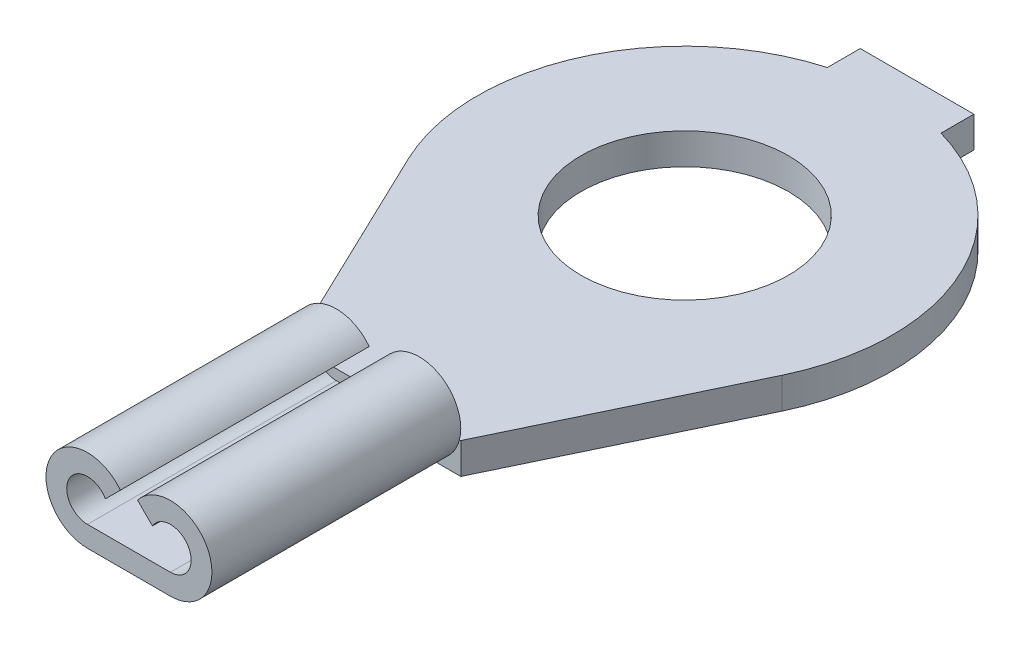
ISO-10303-21;
HEADER;
FILE_DESCRIPTION(('STEP AP214'),'2;1');
FILE_NAME('part.step','',(''),(''),'','','');
FILE_SCHEMA(('AUTOMOTIVE_DESIGN { 1 0 10303 214 1 1 1 1 }'));
ENDSEC;
DATA;
#1=APPLICATION_CONTEXT('core data for automotive mechanical design processes');
#2=APPLICATION_PROTOCOL_DEFINITION('international standard','automotive_design',2000,#1);
#3=PRODUCT_CONTEXT('',#1,'mechanical');
#4=PRODUCT('Part','Part','',(#3));
#5=PRODUCT_RELATED_PRODUCT_CATEGORY('part','',(#4));
#6=PRODUCT_DEFINITION_FORMATION('','',#4);
#7=PRODUCT_DEFINITION_CONTEXT('part definition',#1,'design');
#8=PRODUCT_DEFINITION('design','',#6,#7);
#9=PRODUCT_DEFINITION_SHAPE('','',#8);
#10=(LENGTH_UNIT() NAMED_UNIT(*) SI_UNIT(.MILLI.,.METRE.));
#11=(NAMED_UNIT(*) PLANE_ANGLE_UNIT() SI_UNIT($,.RADIAN.));
#12=(NAMED_UNIT(*) SI_UNIT($,.STERADIAN.) SOLID_ANGLE_UNIT());
#13=UNCERTAINTY_MEASURE_WITH_UNIT(LENGTH_MEASURE(1.E-05),#10,'distance_accuracy_value','');
#14=(GEOMETRIC_REPRESENTATION_CONTEXT(3) GLOBAL_UNCERTAINTY_ASSIGNED_CONTEXT((#13)) GLOBAL_UNIT_ASSIGNED_CONTEXT((#10,
#11,#12)) REPRESENTATION_CONTEXT('',''));
#15=CARTESIAN_POINT('',(0.,0.,0.));
#16=DIRECTION('',(0.,0.,1.));
#17=DIRECTION('',(1.,0.,0.));
#18=AXIS2_PLACEMENT_3D('',#15,#16,#17);
#19=CARTESIAN_POINT('',(0.,0.,0.));
#20=DIRECTION('',(0.,1.,0.));
#21=DIRECTION('',(0.,0.,1.));
#22=AXIS2_PLACEMENT_3D('',#19,#20,#21);
#23=PLANE('',#22);
#24=CARTESIAN_POINT('',(0.,0.,0.));
#25=DIRECTION('',(0.,1.,0.));
#26=DIRECTION('',(0.,0.,1.));
#27=AXIS2_PLACEMENT_3D('',#24,#25,#26);
#28=CIRCLE('',#27,1.27);
#29=CARTESIAN_POINT('',(0.,0.,1.27));
#30=VERTEX_POINT('',#29);
#31=EDGE_CURVE('E342',#30,#30,#28,.T.);
#32=ORIENTED_EDGE('',*,*,#31,.T.);
#33=EDGE_LOOP('',(#32));
#34=FACE_BOUND('',#33,.T.);
#35=DIRECTION('',(0.,0.,1.));
#36=VECTOR('',#35,1.);
#37=CARTESIAN_POINT('',(0.508,0.,3.7585209668621));
#38=LINE('',#37,#36);
#39=CARTESIAN_POINT('',(0.508,0.,3.7585209668621));
#40=VERTEX_POINT('',#39);
#41=CARTESIAN_POINT('',(0.508,0.,6.8065209668621));
#42=VERTEX_POINT('',#41);
#43=EDGE_CURVE('E374',#40,#42,#38,.T.);
#44=ORIENTED_EDGE('',*,*,#43,.T.);
#45=DIRECTION('',(1.,0.,0.));
#46=VECTOR('',#45,1.);
#47=CARTESIAN_POINT('',(-1.016,0.,6.8065209668621));
#48=LINE('',#47,#46);
#49=CARTESIAN_POINT('',(-0.508,0.,6.8065209668621));
#50=VERTEX_POINT('',#49);
#51=EDGE_CURVE('E265',#50,#42,#48,.T.);
#52=ORIENTED_EDGE('',*,*,#51,.F.);
#53=DIRECTION('',(0.,0.,1.));
#54=VECTOR('',#53,1.);
#55=CARTESIAN_POINT('',(-0.508,0.,3.7585209668621));
#56=LINE('',#55,#54);
#57=CARTESIAN_POINT('',(-0.508,0.,3.7585209668621));
#58=VERTEX_POINT('',#57);
#59=EDGE_CURVE('E305',#58,#50,#56,.T.);
#60=ORIENTED_EDGE('',*,*,#59,.F.);
#61=DIRECTION('',(1.,0.,0.));
#62=VECTOR('',#61,1.);
#63=CARTESIAN_POINT('',(0.,0.,3.7585209668621));
#64=LINE('',#63,#62);
#65=CARTESIAN_POINT('',(-1.016,0.,3.7585209668621));
#66=VERTEX_POINT('',#65);
#67=EDGE_CURVE('E293',#66,#58,#64,.T.);
#68=ORIENTED_EDGE('',*,*,#67,.F.);
#69=DIRECTION('',(0.432004694375105,0.,0.901871356701094));
#70=VECTOR('',#69,1.);
#71=CARTESIAN_POINT('',(-1.016,0.,3.7585209668621));
#72=LINE('',#71,#70);
#73=CARTESIAN_POINT('',(-2.29075324602078,0.,1.09729192371277));
#74=VERTEX_POINT('',#73);
#75=EDGE_CURVE('E261',#74,#66,#72,.T.);
#76=ORIENTED_EDGE('',*,*,#75,.F.);
#77=CARTESIAN_POINT('',(0.,0.,0.));
#78=DIRECTION('',(0.,1.,0.));
#79=DIRECTION('',(0.,0.,1.));
#80=AXIS2_PLACEMENT_3D('',#77,#78,#79);
#81=CIRCLE('',#80,2.54);
#82=CARTESIAN_POINT('',(-0.695956455580593,0.,-2.44279442686766));
#83=VERTEX_POINT('',#82);
#84=EDGE_CURVE('E258',#83,#74,#81,.T.);
#85=ORIENTED_EDGE('',*,*,#84,.F.);
#86=DIRECTION('',(0.,0.,1.));
#87=VECTOR('',#86,1.);
#88=CARTESIAN_POINT('',(-0.695956455580593,0.,-2.44279442686766));
#89=LINE('',#88,#87);
#90=CARTESIAN_POINT('',(-0.695956455580593,0.,-2.84547903313789));
#91=VERTEX_POINT('',#90);
#92=EDGE_CURVE('E214',#91,#83,#89,.T.);
#93=ORIENTED_EDGE('',*,*,#92,.F.);
#94=DIRECTION('',(-1.,0.,0.));
#95=VECTOR('',#94,1.);
#96=CARTESIAN_POINT('',(-0.695956455580593,0.,-2.84547903313789));
#97=LINE('',#96,#95);
#98=CARTESIAN_POINT('',(0.695956455580593,0.,-2.84547903313789));
#99=VERTEX_POINT('',#98);
#100=EDGE_CURVE('E208',#99,#91,#97,.T.);
#101=ORIENTED_EDGE('',*,*,#100,.F.);
#102=DIRECTION('',(0.,0.,-1.));
#103=VECTOR('',#102,1.);
#104=CARTESIAN_POINT('',(0.695956455580593,0.,-2.44279442686766));
#105=LINE('',#104,#103);
#106=CARTESIAN_POINT('',(0.695956455580593,0.,-2.44279442686766));
#107=VERTEX_POINT('',#106);
#108=EDGE_CURVE('E248',#107,#99,#105,.T.);
#109=ORIENTED_EDGE('',*,*,#108,.F.);
#110=CARTESIAN_POINT('',(0.,0.,0.));
#111=DIRECTION('',(0.,1.,0.));
#112=DIRECTION('',(0.,0.,1.));
#113=AXIS2_PLACEMENT_3D('',#110,#111,#112);
#114=CIRCLE('',#113,2.54);
#115=CARTESIAN_POINT('',(2.29075324602078,0.,1.09729192371277));
#116=VERTEX_POINT('',#115);
#117=EDGE_CURVE('E270',#116,#107,#114,.T.);
#118=ORIENTED_EDGE('',*,*,#117,.F.);
#119=DIRECTION('',(0.432004694375105,0.,-0.901871356701094));
#120=VECTOR('',#119,1.);
#121=CARTESIAN_POINT('',(1.016,0.,3.7585209668621));
#122=LINE('',#121,#120);
#123=CARTESIAN_POINT('',(1.016,0.,3.7585209668621));
#124=VERTEX_POINT('',#123);
#125=EDGE_CURVE('E268',#124,#116,#122,.T.);
#126=ORIENTED_EDGE('',*,*,#125,.F.);
#127=DIRECTION('',(1.,0.,0.));
#128=VECTOR('',#127,1.);
#129=CARTESIAN_POINT('',(0.,0.,3.7585209668621));
#130=LINE('',#129,#128);
#131=EDGE_CURVE('E335',#40,#124,#130,.T.);
#132=ORIENTED_EDGE('',*,*,#131,.F.);
#133=EDGE_LOOP('',(#44,#52,#60,#68,#76,#85,#93,#101,#109,#118,#126,#132));
#134=FACE_BOUND('',#133,.T.);
#135=ADVANCED_FACE('F167',(#34,#134),#23,.F.);
#136=CARTESIAN_POINT('',(-1.016,0.381,6.8065209668621));
#137=DIRECTION('',(0.,0.,-1.));
#138=DIRECTION('',(-1.,0.,0.));
#139=AXIS2_PLACEMENT_3D('',#136,#137,#138);
#140=PLANE('',#139);
#141=ORIENTED_EDGE('',*,*,#51,.T.);
#142=CARTESIAN_POINT('',(0.508,0.508,6.8065209668621));
#143=DIRECTION('',(0.,0.,1.));
#144=DIRECTION('',(1.,0.,0.));
#145=AXIS2_PLACEMENT_3D('',#142,#143,#144);
#146=CIRCLE('',#145,0.508);
#147=CARTESIAN_POINT('',(0.105325043747218,0.817704503691535,6.8065209668621));
#148=VERTEX_POINT('',#147);
#149=EDGE_CURVE('E398',#148,#42,#146,.F.);
#150=ORIENTED_EDGE('',*,*,#149,.F.);
#151=DIRECTION('',(-0.707106781186546,0.707106781186549,0.));
#152=VECTOR('',#151,1.);
#153=CARTESIAN_POINT('',(0.461514773719377,0.461514773719375,6.8065209668621));
#154=LINE('',#153,#152);
#155=CARTESIAN_POINT('',(0.288029547438752,0.635,6.8065209668621));
#156=VERTEX_POINT('',#155);
#157=EDGE_CURVE('E383',#156,#148,#154,.T.);
#158=ORIENTED_EDGE('',*,*,#157,.F.);
#159=CARTESIAN_POINT('',(0.508,0.508,6.8065209668621));
#160=DIRECTION('',(0.,0.,1.));
#161=DIRECTION('',(1.,0.,0.));
#162=AXIS2_PLACEMENT_3D('',#159,#160,#161);
#163=CIRCLE('',#162,0.254);
#164=CARTESIAN_POINT('',(0.508,0.254,6.8065209668621));
#165=VERTEX_POINT('',#164);
#166=EDGE_CURVE('E410',#156,#165,#163,.F.);
#167=ORIENTED_EDGE('',*,*,#166,.T.);
#168=DIRECTION('',(1.,0.,0.));
#169=VECTOR('',#168,1.);
#170=CARTESIAN_POINT('',(0.,0.254,6.8065209668621));
#171=LINE('',#170,#169);
#172=CARTESIAN_POINT('',(-0.508,0.254,6.8065209668621));
#173=VERTEX_POINT('',#172);
#174=EDGE_CURVE('E369',#173,#165,#171,.T.);
#175=ORIENTED_EDGE('',*,*,#174,.F.);
#176=CARTESIAN_POINT('',(-0.508,0.508,6.8065209668621));
#177=DIRECTION('',(0.,0.,1.));
#178=DIRECTION('',(1.,0.,0.));
#179=AXIS2_PLACEMENT_3D('',#176,#177,#178);
#180=CIRCLE('',#179,0.254);
#181=CARTESIAN_POINT('',(-0.288029547438752,0.635,6.8065209668621));
#182=VERTEX_POINT('',#181);
#183=EDGE_CURVE('E401',#182,#173,#180,.T.);
#184=ORIENTED_EDGE('',*,*,#183,.F.);
#185=DIRECTION('',(0.707106781186546,0.707106781186549,0.));
#186=VECTOR('',#185,1.);
#187=CARTESIAN_POINT('',(-0.461514773719377,0.461514773719375,6.8065209668621));
#188=LINE('',#187,#186);
#189=CARTESIAN_POINT('',(-0.105325043747218,0.817704503691535,6.8065209668621));
#190=VERTEX_POINT('',#189);
#191=EDGE_CURVE('E402',#182,#190,#188,.T.);
#192=ORIENTED_EDGE('',*,*,#191,.T.);
#193=CARTESIAN_POINT('',(-0.508,0.508,6.8065209668621));
#194=DIRECTION('',(0.,0.,1.));
#195=DIRECTION('',(1.,0.,0.));
#196=AXIS2_PLACEMENT_3D('',#193,#194,#195);
#197=CIRCLE('',#196,0.508);
#198=EDGE_CURVE('E357',#190,#50,#197,.T.);
#199=ORIENTED_EDGE('',*,*,#198,.T.);
#200=EDGE_LOOP('',(#141,#150,#158,#167,#175,#184,#192,#199));
#201=FACE_BOUND('',#200,.T.);
#202=ADVANCED_FACE('F433',(#201),#140,.F.);
#203=CARTESIAN_POINT('',(-1.016,1.016,3.7585209668621));
#204=DIRECTION('',(0.,0.,1.));
#205=DIRECTION('',(1.,0.,0.));
#206=AXIS2_PLACEMENT_3D('',#203,#204,#205);
#207=PLANE('',#206);
#208=CARTESIAN_POINT('',(0.508,0.508,3.7585209668621));
#209=DIRECTION('',(0.,0.,1.));
#210=DIRECTION('',(1.,0.,0.));
#211=AXIS2_PLACEMENT_3D('',#208,#209,#210);
#212=CIRCLE('',#211,0.508);
#213=CARTESIAN_POINT('',(0.105325043747218,0.817704503691535,3.7585209668621));
#214=VERTEX_POINT('',#213);
#215=CARTESIAN_POINT('',(0.999868884968342,0.381,3.7585209668621));
#216=VERTEX_POINT('',#215);
#217=EDGE_CURVE('E375',#214,#216,#212,.F.);
#218=ORIENTED_EDGE('',*,*,#217,.T.);
#219=DIRECTION('',(-1.,0.,0.));
#220=VECTOR('',#219,1.);
#221=CARTESIAN_POINT('',(-1.016,0.381,3.7585209668621));
#222=LINE('',#221,#220);
#223=CARTESIAN_POINT('',(0.727970452561247,0.381,3.7585209668621));
#224=VERTEX_POINT('',#223);
#225=EDGE_CURVE('E341',#216,#224,#222,.T.);
#226=ORIENTED_EDGE('',*,*,#225,.T.);
#227=CARTESIAN_POINT('',(0.508,0.508,3.7585209668621));
#228=DIRECTION('',(0.,0.,1.));
#229=DIRECTION('',(1.,0.,0.));
#230=AXIS2_PLACEMENT_3D('',#227,#228,#229);
#231=CIRCLE('',#230,0.254);
#232=CARTESIAN_POINT('',(0.288029547438752,0.635,3.7585209668621));
#233=VERTEX_POINT('',#232);
#234=EDGE_CURVE('E384',#233,#224,#231,.F.);
#235=ORIENTED_EDGE('',*,*,#234,.F.);
#236=DIRECTION('',(-0.707106781186546,0.707106781186549,0.));
#237=VECTOR('',#236,1.);
#238=CARTESIAN_POINT('',(0.461514773719377,0.461514773719375,3.7585209668621));
#239=LINE('',#238,#237);
#240=EDGE_CURVE('E370',#233,#214,#239,.T.);
#241=ORIENTED_EDGE('',*,*,#240,.T.);
#242=EDGE_LOOP('',(#218,#226,#235,#241));
#243=FACE_BOUND('',#242,.T.);
#244=ADVANCED_FACE('F460',(#243),#207,.F.);
#245=DIRECTION('',(0.707106781186546,0.707106781186549,0.));
#246=VECTOR('',#245,1.);
#247=CARTESIAN_POINT('',(-0.461514773719377,0.461514773719375,3.7585209668621));
#248=LINE('',#247,#246);
#249=CARTESIAN_POINT('',(-0.288029547438752,0.635,3.7585209668621));
#250=VERTEX_POINT('',#249);
#251=CARTESIAN_POINT('',(-0.105325043747218,0.817704503691535,3.7585209668621));
#252=VERTEX_POINT('',#251);
#253=EDGE_CURVE('E380',#250,#252,#248,.T.);
#254=ORIENTED_EDGE('',*,*,#253,.F.);
#255=CARTESIAN_POINT('',(-0.508,0.508,3.7585209668621));
#256=DIRECTION('',(0.,0.,1.));
#257=DIRECTION('',(1.,0.,0.));
#258=AXIS2_PLACEMENT_3D('',#255,#256,#257);
#259=CIRCLE('',#258,0.254);
#260=CARTESIAN_POINT('',(-0.727970452561247,0.381,3.7585209668621));
#261=VERTEX_POINT('',#260);
#262=EDGE_CURVE('E385',#250,#261,#259,.T.);
#263=ORIENTED_EDGE('',*,*,#262,.T.);
#264=CARTESIAN_POINT('',(-0.999868884968342,0.381,3.7585209668621));
#265=VERTEX_POINT('',#264);
#266=EDGE_CURVE('E344',#261,#265,#222,.T.);
#267=ORIENTED_EDGE('',*,*,#266,.T.);
#268=CARTESIAN_POINT('',(-0.508,0.508,3.7585209668621));
#269=DIRECTION('',(0.,0.,1.));
#270=DIRECTION('',(1.,0.,0.));
#271=AXIS2_PLACEMENT_3D('',#268,#269,#270);
#272=CIRCLE('',#271,0.508);
#273=EDGE_CURVE('E350',#252,#265,#272,.T.);
#274=ORIENTED_EDGE('',*,*,#273,.F.);
#275=EDGE_LOOP('',(#254,#263,#267,#274));
#276=FACE_BOUND('',#275,.T.);
#277=ADVANCED_FACE('F452',(#276),#207,.F.);
#278=CARTESIAN_POINT('',(0.,0.381,0.));
#279=DIRECTION('',(0.,1.,0.));
#280=DIRECTION('',(0.,0.,1.));
#281=AXIS2_PLACEMENT_3D('',#278,#279,#280);
#282=PLANE('',#281);
#283=CARTESIAN_POINT('',(1.016,0.381,3.7585209668621));
#284=VERTEX_POINT('',#283);
#285=EDGE_CURVE('E333',#284,#216,#222,.T.);
#286=ORIENTED_EDGE('',*,*,#285,.F.);
#287=DIRECTION('',(0.432004694375105,0.,-0.901871356701094));
#288=VECTOR('',#287,1.);
#289=CARTESIAN_POINT('',(1.016,0.381,3.7585209668621));
#290=LINE('',#289,#288);
#291=CARTESIAN_POINT('',(2.29075324602078,0.381,1.09729192371277));
#292=VERTEX_POINT('',#291);
#293=EDGE_CURVE('E323',#284,#292,#290,.T.);
#294=ORIENTED_EDGE('',*,*,#293,.T.);
#295=CARTESIAN_POINT('',(0.,0.381,0.));
#296=DIRECTION('',(0.,1.,0.));
#297=DIRECTION('',(0.,0.,1.));
#298=AXIS2_PLACEMENT_3D('',#295,#296,#297);
#299=CIRCLE('',#298,2.54);
#300=CARTESIAN_POINT('',(0.695956455580593,0.381,-2.44279442686766));
#301=VERTEX_POINT('',#300);
#302=EDGE_CURVE('E240',#292,#301,#299,.T.);
#303=ORIENTED_EDGE('',*,*,#302,.T.);
#304=DIRECTION('',(0.,0.,-1.));
#305=VECTOR('',#304,1.);
#306=CARTESIAN_POINT('',(0.695956455580593,0.381,-2.44279442686766));
#307=LINE('',#306,#305);
#308=CARTESIAN_POINT('',(0.695956455580593,0.381,-2.84547903313789));
#309=VERTEX_POINT('',#308);
#310=EDGE_CURVE('E232',#301,#309,#307,.T.);
#311=ORIENTED_EDGE('',*,*,#310,.T.);
#312=DIRECTION('',(-1.,0.,0.));
#313=VECTOR('',#312,1.);
#314=CARTESIAN_POINT('',(-0.695956455580593,0.381,-2.84547903313789));
#315=LINE('',#314,#313);
#316=CARTESIAN_POINT('',(-0.695956455580593,0.381,-2.84547903313789));
#317=VERTEX_POINT('',#316);
#318=EDGE_CURVE('E238',#309,#317,#315,.T.);
#319=ORIENTED_EDGE('',*,*,#318,.T.);
#320=DIRECTION('',(0.,0.,1.));
#321=VECTOR('',#320,1.);
#322=CARTESIAN_POINT('',(-0.695956455580593,0.381,-2.44279442686766));
#323=LINE('',#322,#321);
#324=CARTESIAN_POINT('',(-0.695956455580593,0.381,-2.44279442686766));
#325=VERTEX_POINT('',#324);
#326=EDGE_CURVE('E184',#317,#325,#323,.T.);
#327=ORIENTED_EDGE('',*,*,#326,.T.);
#328=CARTESIAN_POINT('',(0.,0.381,0.));
#329=DIRECTION('',(0.,1.,0.));
#330=DIRECTION('',(0.,0.,1.));
#331=AXIS2_PLACEMENT_3D('',#328,#329,#330);
#332=CIRCLE('',#331,2.54);
#333=CARTESIAN_POINT('',(-2.29075324602078,0.381,1.09729192371277));
#334=VERTEX_POINT('',#333);
#335=EDGE_CURVE('E275',#325,#334,#332,.T.);
#336=ORIENTED_EDGE('',*,*,#335,.T.);
#337=DIRECTION('',(0.432004694375105,0.,0.901871356701094));
#338=VECTOR('',#337,1.);
#339=CARTESIAN_POINT('',(-1.016,0.381,3.7585209668621));
#340=LINE('',#339,#338);
#341=CARTESIAN_POINT('',(-1.016,0.381,3.7585209668621));
#342=VERTEX_POINT('',#341);
#343=EDGE_CURVE('E222',#334,#342,#340,.T.);
#344=ORIENTED_EDGE('',*,*,#343,.T.);
#345=DIRECTION('',(1.,0.,0.));
#346=VECTOR('',#345,1.);
#347=CARTESIAN_POINT('',(0.,0.381,3.7585209668621));
#348=LINE('',#347,#346);
#349=EDGE_CURVE('E296',#342,#265,#348,.T.);
#350=ORIENTED_EDGE('',*,*,#349,.T.);
#351=ORIENTED_EDGE('',*,*,#266,.F.);
#352=DIRECTION('',(1.,0.,0.));
#353=VECTOR('',#352,1.);
#354=CARTESIAN_POINT('',(0.,0.381,3.7585209668621));
#355=LINE('',#354,#353);
#356=EDGE_CURVE('E306',#261,#224,#355,.T.);
#357=ORIENTED_EDGE('',*,*,#356,.T.);
#358=ORIENTED_EDGE('',*,*,#225,.F.);
#359=EDGE_LOOP('',(#286,#294,#303,#311,#319,#327,#336,#344,#350,#351,#357,#358));
#360=FACE_BOUND('',#359,.T.);
#361=CARTESIAN_POINT('',(0.,0.381,0.));
#362=DIRECTION('',(0.,1.,0.));
#363=DIRECTION('',(0.,0.,1.));
#364=AXIS2_PLACEMENT_3D('',#361,#362,#363);
#365=CIRCLE('',#364,1.27);
#366=CARTESIAN_POINT('',(0.,0.381,1.27));
#367=VERTEX_POINT('',#366);
#368=EDGE_CURVE('E262',#367,#367,#365,.T.);
#369=ORIENTED_EDGE('',*,*,#368,.F.);
#370=EDGE_LOOP('',(#369));
#371=FACE_BOUND('',#370,.T.);
#372=ADVANCED_FACE('F235',(#360,#371),#282,.T.);
#373=CARTESIAN_POINT('',(0.,0.381,0.));
#374=DIRECTION('',(0.,-1.,0.));
#375=DIRECTION('',(0.,0.,-1.));
#376=AXIS2_PLACEMENT_3D('',#373,#374,#375);
#377=CYLINDRICAL_SURFACE('',#376,2.54);
#378=ORIENTED_EDGE('',*,*,#84,.T.);
#379=DIRECTION('',(0.,-1.,0.));
#380=VECTOR('',#379,1.);
#381=CARTESIAN_POINT('',(-2.29075324602078,0.381,1.09729192371277));
#382=LINE('',#381,#380);
#383=EDGE_CURVE('E12',#334,#74,#382,.T.);
#384=ORIENTED_EDGE('',*,*,#383,.F.);
#385=ORIENTED_EDGE('',*,*,#335,.F.);
#386=DIRECTION('',(0.,-1.,0.));
#387=VECTOR('',#386,1.);
#388=CARTESIAN_POINT('',(-0.695956455580593,0.381,-2.44279442686766));
#389=LINE('',#388,#387);
#390=EDGE_CURVE('E254',#325,#83,#389,.T.);
#391=ORIENTED_EDGE('',*,*,#390,.T.);
#392=EDGE_LOOP('',(#378,#384,#385,#391));
#393=FACE_BOUND('',#392,.T.);
#394=ADVANCED_FACE('F169',(#393),#377,.T.);
#395=CARTESIAN_POINT('',(-1.016,0.381,3.7585209668621));
#396=DIRECTION('',(0.901871356701094,0.,-0.432004694375105));
#397=DIRECTION('',(-0.432004694375105,0.,-0.901871356701094));
#398=AXIS2_PLACEMENT_3D('',#395,#396,#397);
#399=PLANE('',#398);
#400=ORIENTED_EDGE('',*,*,#75,.T.);
#401=DIRECTION('',(0.,-1.,0.));
#402=VECTOR('',#401,1.);
#403=CARTESIAN_POINT('',(-1.016,0.381,3.7585209668621));
#404=LINE('',#403,#402);
#405=EDGE_CURVE('E176',#342,#66,#404,.T.);
#406=ORIENTED_EDGE('',*,*,#405,.F.);
#407=ORIENTED_EDGE('',*,*,#343,.F.);
#408=ORIENTED_EDGE('',*,*,#383,.T.);
#409=EDGE_LOOP('',(#400,#406,#407,#408));
#410=FACE_BOUND('',#409,.T.);
#411=ADVANCED_FACE('F308',(#410),#399,.F.);
#412=CARTESIAN_POINT('',(1.016,0.381,3.7585209668621));
#413=DIRECTION('',(-0.901871356701094,0.,-0.432004694375105));
#414=DIRECTION('',(-0.432004694375105,0.,0.901871356701094));
#415=AXIS2_PLACEMENT_3D('',#412,#413,#414);
#416=PLANE('',#415);
#417=ORIENTED_EDGE('',*,*,#125,.T.);
#418=DIRECTION('',(0.,-1.,0.));
#419=VECTOR('',#418,1.);
#420=CARTESIAN_POINT('',(2.29075324602078,0.381,1.09729192371277));
#421=LINE('',#420,#419);
#422=EDGE_CURVE('E279',#292,#116,#421,.T.);
#423=ORIENTED_EDGE('',*,*,#422,.F.);
#424=ORIENTED_EDGE('',*,*,#293,.F.);
#425=DIRECTION('',(0.,-1.,0.));
#426=VECTOR('',#425,1.);
#427=CARTESIAN_POINT('',(1.016,0.381,3.7585209668621));
#428=LINE('',#427,#426);
#429=EDGE_CURVE('E282',#284,#124,#428,.T.);
#430=ORIENTED_EDGE('',*,*,#429,.T.);
#431=EDGE_LOOP('',(#417,#423,#424,#430));
#432=FACE_BOUND('',#431,.T.);
#433=ADVANCED_FACE('F321',(#432),#416,.F.);
#434=CARTESIAN_POINT('',(0.,0.381,0.));
#435=DIRECTION('',(0.,-1.,0.));
#436=DIRECTION('',(0.,0.,-1.));
#437=AXIS2_PLACEMENT_3D('',#434,#435,#436);
#438=CYLINDRICAL_SURFACE('',#437,2.54);
#439=ORIENTED_EDGE('',*,*,#117,.T.);
#440=DIRECTION('',(0.,-1.,0.));
#441=VECTOR('',#440,1.);
#442=CARTESIAN_POINT('',(0.695956455580593,0.381,-2.44279442686766));
#443=LINE('',#442,#441);
#444=EDGE_CURVE('E249',#301,#107,#443,.T.);
#445=ORIENTED_EDGE('',*,*,#444,.F.);
#446=ORIENTED_EDGE('',*,*,#302,.F.);
#447=ORIENTED_EDGE('',*,*,#422,.T.);
#448=EDGE_LOOP('',(#439,#445,#446,#447));
#449=FACE_BOUND('',#448,.T.);
#450=ADVANCED_FACE('F317',(#449),#438,.T.);
#451=CARTESIAN_POINT('',(0.695956455580593,0.381,-2.44279442686766));
#452=DIRECTION('',(-1.,0.,0.));
#453=DIRECTION('',(0.,0.,1.));
#454=AXIS2_PLACEMENT_3D('',#451,#452,#453);
#455=PLANE('',#454);
#456=ORIENTED_EDGE('',*,*,#108,.T.);
#457=DIRECTION('',(0.,-1.,0.));
#458=VECTOR('',#457,1.);
#459=CARTESIAN_POINT('',(0.695956455580593,0.381,-2.84547903313789));
#460=LINE('',#459,#458);
#461=EDGE_CURVE('E245',#309,#99,#460,.T.);
#462=ORIENTED_EDGE('',*,*,#461,.F.);
#463=ORIENTED_EDGE('',*,*,#310,.F.);
#464=ORIENTED_EDGE('',*,*,#444,.T.);
#465=EDGE_LOOP('',(#456,#462,#463,#464));
#466=FACE_BOUND('',#465,.T.);
#467=ADVANCED_FACE('F246',(#466),#455,.F.);
#468=CARTESIAN_POINT('',(-0.695956455580593,0.381,-2.84547903313789));
#469=DIRECTION('',(0.,0.,1.));
#470=DIRECTION('',(1.,0.,0.));
#471=AXIS2_PLACEMENT_3D('',#468,#469,#470);
#472=PLANE('',#471);
#473=ORIENTED_EDGE('',*,*,#100,.T.);
#474=DIRECTION('',(0.,-1.,0.));
#475=VECTOR('',#474,1.);
#476=CARTESIAN_POINT('',(-0.695956455580593,0.381,-2.84547903313789));
#477=LINE('',#476,#475);
#478=EDGE_CURVE('E250',#317,#91,#477,.T.);
#479=ORIENTED_EDGE('',*,*,#478,.F.);
#480=ORIENTED_EDGE('',*,*,#318,.F.);
#481=ORIENTED_EDGE('',*,*,#461,.T.);
#482=EDGE_LOOP('',(#473,#479,#480,#481));
#483=FACE_BOUND('',#482,.T.);
#484=ADVANCED_FACE('F252',(#483),#472,.F.);
#485=CARTESIAN_POINT('',(-0.695956455580593,0.381,-2.44279442686766));
#486=DIRECTION('',(1.,0.,0.));
#487=DIRECTION('',(0.,0.,-1.));
#488=AXIS2_PLACEMENT_3D('',#485,#486,#487);
#489=PLANE('',#488);
#490=ORIENTED_EDGE('',*,*,#92,.T.);
#491=ORIENTED_EDGE('',*,*,#390,.F.);
#492=ORIENTED_EDGE('',*,*,#326,.F.);
#493=ORIENTED_EDGE('',*,*,#478,.T.);
#494=EDGE_LOOP('',(#490,#491,#492,#493));
#495=FACE_BOUND('',#494,.T.);
#496=ADVANCED_FACE('F473',(#495),#489,.F.);
#497=CARTESIAN_POINT('',(0.,0.381,0.));
#498=DIRECTION('',(0.,-1.,0.));
#499=DIRECTION('',(0.,0.,-1.));
#500=AXIS2_PLACEMENT_3D('',#497,#498,#499);
#501=CYLINDRICAL_SURFACE('',#500,1.27);
#502=ORIENTED_EDGE('',*,*,#368,.T.);
#503=EDGE_LOOP('',(#502));
#504=FACE_BOUND('',#503,.T.);
#505=ORIENTED_EDGE('',*,*,#31,.F.);
#506=EDGE_LOOP('',(#505));
#507=FACE_BOUND('',#506,.T.);
#508=ADVANCED_FACE('F449',(#504,#507),#501,.F.);
#509=CARTESIAN_POINT('',(-0.508,0.508,3.7585209668621));
#510=DIRECTION('',(0.,0.,1.));
#511=DIRECTION('',(1.,0.,0.));
#512=AXIS2_PLACEMENT_3D('',#509,#510,#511);
#513=CYLINDRICAL_SURFACE('',#512,0.508);
#514=ORIENTED_EDGE('',*,*,#198,.F.);
#515=DIRECTION('',(0.,0.,1.));
#516=VECTOR('',#515,1.);
#517=CARTESIAN_POINT('',(-0.105325043747218,0.817704503691535,3.7585209668621));
#518=LINE('',#517,#516);
#519=EDGE_CURVE('E379',#252,#190,#518,.T.);
#520=ORIENTED_EDGE('',*,*,#519,.F.);
#521=ORIENTED_EDGE('',*,*,#273,.T.);
#522=CARTESIAN_POINT('',(-0.508,0.508,3.7585209668621));
#523=DIRECTION('',(0.,0.,1.));
#524=DIRECTION('',(1.,0.,0.));
#525=AXIS2_PLACEMENT_3D('',#522,#523,#524);
#526=CIRCLE('',#525,0.508);
#527=EDGE_CURVE('E365',#265,#58,#526,.T.);
#528=ORIENTED_EDGE('',*,*,#527,.T.);
#529=ORIENTED_EDGE('',*,*,#59,.T.);
#530=EDGE_LOOP('',(#514,#520,#521,#528,#529));
#531=FACE_BOUND('',#530,.T.);
#532=ADVANCED_FACE('F441',(#531),#513,.T.);
#533=CARTESIAN_POINT('',(0.,0.,3.7585209668621));
#534=DIRECTION('',(0.,0.,1.));
#535=DIRECTION('',(1.,0.,0.));
#536=AXIS2_PLACEMENT_3D('',#533,#534,#535);
#537=PLANE('',#536);
#538=ORIENTED_EDGE('',*,*,#405,.T.);
#539=ORIENTED_EDGE('',*,*,#67,.T.);
#540=ORIENTED_EDGE('',*,*,#527,.F.);
#541=ORIENTED_EDGE('',*,*,#349,.F.);
#542=EDGE_LOOP('',(#538,#539,#540,#541));
#543=FACE_BOUND('',#542,.T.);
#544=ADVANCED_FACE('F290',(#543),#537,.T.);
#545=CARTESIAN_POINT('',(0.461514773719377,0.461514773719375,3.7585209668621));
#546=DIRECTION('',(0.707106781186549,0.707106781186546,0.));
#547=DIRECTION('',(-0.707106781186546,0.707106781186549,0.));
#548=AXIS2_PLACEMENT_3D('',#545,#546,#547);
#549=PLANE('',#548);
#550=ORIENTED_EDGE('',*,*,#157,.T.);
#551=DIRECTION('',(0.,0.,1.));
#552=VECTOR('',#551,1.);
#553=CARTESIAN_POINT('',(0.105325043747218,0.817704503691535,3.7585209668621));
#554=LINE('',#553,#552);
#555=EDGE_CURVE('E373',#214,#148,#554,.T.);
#556=ORIENTED_EDGE('',*,*,#555,.F.);
#557=ORIENTED_EDGE('',*,*,#240,.F.);
#558=DIRECTION('',(0.,0.,1.));
#559=VECTOR('',#558,1.);
#560=CARTESIAN_POINT('',(0.288029547438752,0.635,3.7585209668621));
#561=LINE('',#560,#559);
#562=EDGE_CURVE('E393',#233,#156,#561,.T.);
#563=ORIENTED_EDGE('',*,*,#562,.T.);
#564=EDGE_LOOP('',(#550,#556,#557,#563));
#565=FACE_BOUND('',#564,.T.);
#566=ADVANCED_FACE('F505',(#565),#549,.F.);
#567=CARTESIAN_POINT('',(0.508,0.508,3.7585209668621));
#568=DIRECTION('',(0.,0.,1.));
#569=DIRECTION('',(1.,0.,0.));
#570=AXIS2_PLACEMENT_3D('',#567,#568,#569);
#571=CYLINDRICAL_SURFACE('',#570,0.254);
#572=ORIENTED_EDGE('',*,*,#166,.F.);
#573=ORIENTED_EDGE('',*,*,#562,.F.);
#574=ORIENTED_EDGE('',*,*,#234,.T.);
#575=CARTESIAN_POINT('',(0.508,0.254,3.7585209668621));
#576=VERTEX_POINT('',#575);
#577=EDGE_CURVE('E378',#224,#576,#231,.F.);
#578=ORIENTED_EDGE('',*,*,#577,.T.);
#579=DIRECTION('',(0.,0.,1.));
#580=VECTOR('',#579,1.);
#581=CARTESIAN_POINT('',(0.508,0.254,3.7585209668621));
#582=LINE('',#581,#580);
#583=EDGE_CURVE('E392',#576,#165,#582,.T.);
#584=ORIENTED_EDGE('',*,*,#583,.T.);
#585=EDGE_LOOP('',(#572,#573,#574,#578,#584));
#586=FACE_BOUND('',#585,.T.);
#587=ADVANCED_FACE('F514',(#586),#571,.F.);
#588=CARTESIAN_POINT('',(0.,0.254,3.7585209668621));
#589=DIRECTION('',(0.,-1.,0.));
#590=DIRECTION('',(0.,0.,-1.));
#591=AXIS2_PLACEMENT_3D('',#588,#589,#590);
#592=PLANE('',#591);
#593=ORIENTED_EDGE('',*,*,#174,.T.);
#594=ORIENTED_EDGE('',*,*,#583,.F.);
#595=DIRECTION('',(1.,0.,0.));
#596=VECTOR('',#595,1.);
#597=CARTESIAN_POINT('',(0.,0.254,3.7585209668621));
#598=LINE('',#597,#596);
#599=CARTESIAN_POINT('',(-0.508,0.254,3.7585209668621));
#600=VERTEX_POINT('',#599);
#601=EDGE_CURVE('E389',#600,#576,#598,.T.);
#602=ORIENTED_EDGE('',*,*,#601,.F.);
#603=DIRECTION('',(0.,0.,1.));
#604=VECTOR('',#603,1.);
#605=CARTESIAN_POINT('',(-0.508,0.254,3.7585209668621));
#606=LINE('',#605,#604);
#607=EDGE_CURVE('E387',#600,#173,#606,.T.);
#608=ORIENTED_EDGE('',*,*,#607,.T.);
#609=EDGE_LOOP('',(#593,#594,#602,#608));
#610=FACE_BOUND('',#609,.T.);
#611=ADVANCED_FACE('F524',(#610),#592,.F.);
#612=CARTESIAN_POINT('',(-0.508,0.508,3.7585209668621));
#613=DIRECTION('',(0.,0.,1.));
#614=DIRECTION('',(1.,0.,0.));
#615=AXIS2_PLACEMENT_3D('',#612,#613,#614);
#616=CYLINDRICAL_SURFACE('',#615,0.254);
#617=ORIENTED_EDGE('',*,*,#183,.T.);
#618=ORIENTED_EDGE('',*,*,#607,.F.);
#619=EDGE_CURVE('E388',#261,#600,#259,.T.);
#620=ORIENTED_EDGE('',*,*,#619,.F.);
#621=ORIENTED_EDGE('',*,*,#262,.F.);
#622=DIRECTION('',(0.,0.,1.));
#623=VECTOR('',#622,1.);
#624=CARTESIAN_POINT('',(-0.288029547438752,0.635,3.7585209668621));
#625=LINE('',#624,#623);
#626=EDGE_CURVE('E405',#250,#182,#625,.T.);
#627=ORIENTED_EDGE('',*,*,#626,.T.);
#628=EDGE_LOOP('',(#617,#618,#620,#621,#627));
#629=FACE_BOUND('',#628,.T.);
#630=ADVANCED_FACE('F534',(#629),#616,.F.);
#631=CARTESIAN_POINT('',(-0.461514773719377,0.461514773719375,3.7585209668621));
#632=DIRECTION('',(0.707106781186549,-0.707106781186546,0.));
#633=DIRECTION('',(0.707106781186546,0.707106781186549,0.));
#634=AXIS2_PLACEMENT_3D('',#631,#632,#633);
#635=PLANE('',#634);
#636=ORIENTED_EDGE('',*,*,#191,.F.);
#637=ORIENTED_EDGE('',*,*,#626,.F.);
#638=ORIENTED_EDGE('',*,*,#253,.T.);
#639=ORIENTED_EDGE('',*,*,#519,.T.);
#640=EDGE_LOOP('',(#636,#637,#638,#639));
#641=FACE_BOUND('',#640,.T.);
#642=ADVANCED_FACE('F544',(#641),#635,.T.);
#643=CARTESIAN_POINT('',(0.508,0.508,3.7585209668621));
#644=DIRECTION('',(0.,0.,1.));
#645=DIRECTION('',(1.,0.,0.));
#646=AXIS2_PLACEMENT_3D('',#643,#644,#645);
#647=CYLINDRICAL_SURFACE('',#646,0.508);
#648=ORIENTED_EDGE('',*,*,#149,.T.);
#649=ORIENTED_EDGE('',*,*,#43,.F.);
#650=CARTESIAN_POINT('',(0.508,0.508,3.7585209668621));
#651=DIRECTION('',(0.,0.,1.));
#652=DIRECTION('',(1.,0.,0.));
#653=AXIS2_PLACEMENT_3D('',#650,#651,#652);
#654=CIRCLE('',#653,0.508);
#655=EDGE_CURVE('E425',#216,#40,#654,.F.);
#656=ORIENTED_EDGE('',*,*,#655,.F.);
#657=ORIENTED_EDGE('',*,*,#217,.F.);
#658=ORIENTED_EDGE('',*,*,#555,.T.);
#659=EDGE_LOOP('',(#648,#649,#656,#657,#658));
#660=FACE_BOUND('',#659,.T.);
#661=ADVANCED_FACE('F554',(#660),#647,.T.);
#662=CARTESIAN_POINT('',(0.,0.,3.7585209668621));
#663=DIRECTION('',(0.,0.,1.));
#664=DIRECTION('',(1.,0.,0.));
#665=AXIS2_PLACEMENT_3D('',#662,#663,#664);
#666=PLANE('',#665);
#667=ORIENTED_EDGE('',*,*,#619,.T.);
#668=ORIENTED_EDGE('',*,*,#601,.T.);
#669=ORIENTED_EDGE('',*,*,#577,.F.);
#670=ORIENTED_EDGE('',*,*,#356,.F.);
#671=EDGE_LOOP('',(#667,#668,#669,#670));
#672=FACE_BOUND('',#671,.T.);
#673=ADVANCED_FACE('F565',(#672),#666,.T.);
#674=CARTESIAN_POINT('',(0.,0.,3.7585209668621));
#675=DIRECTION('',(0.,0.,1.));
#676=DIRECTION('',(1.,0.,0.));
#677=AXIS2_PLACEMENT_3D('',#674,#675,#676);
#678=PLANE('',#677);
#679=ORIENTED_EDGE('',*,*,#655,.T.);
#680=ORIENTED_EDGE('',*,*,#131,.T.);
#681=ORIENTED_EDGE('',*,*,#429,.F.);
#682=ORIENTED_EDGE('',*,*,#285,.T.);
#683=EDGE_LOOP('',(#679,#680,#681,#682));
#684=FACE_BOUND('',#683,.T.);
#685=ADVANCED_FACE('F331',(#684),#678,.T.);
#686=CLOSED_SHELL('',(#135,#202,#244,#277,#372,#394,#411,#433,#450,#467,#484,#496,#508,#532,
#544,#566,#587,#611,#630,#642,#661,#673,#685));
#687=MANIFOLD_SOLID_BREP('B2',#686);
#688=ADVANCED_BREP_SHAPE_REPRESENTATION('',(#18,#687),#14);
#689=SHAPE_DEFINITION_REPRESENTATION(#9,#688);
ENDSEC;
END-ISO-10303-21;
